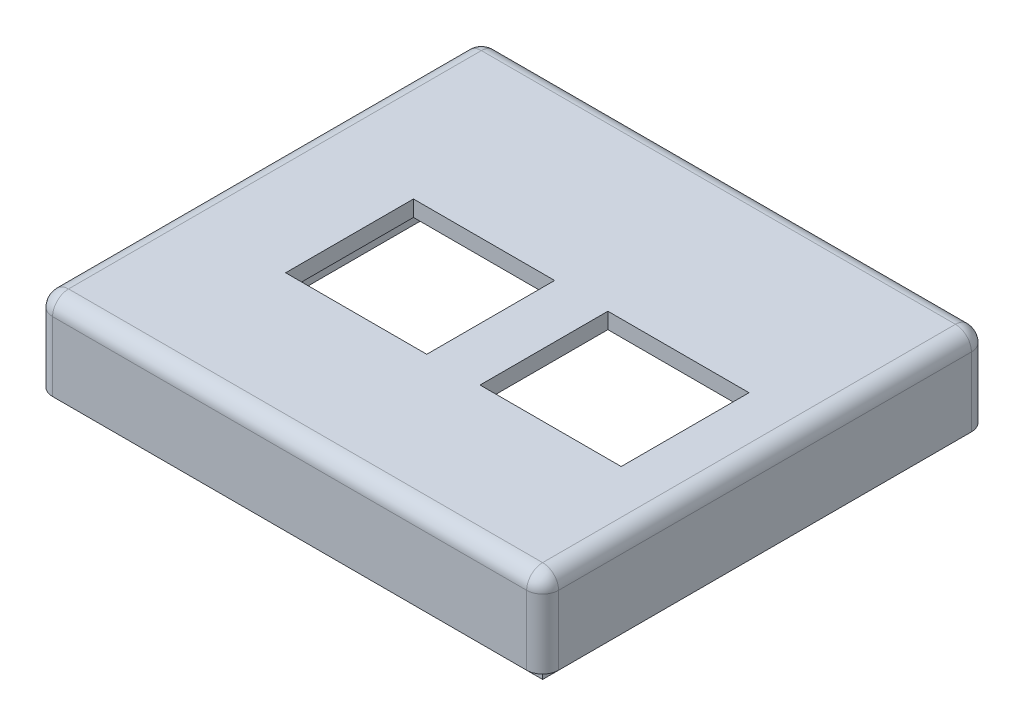
ISO-10303-21;
HEADER;
FILE_DESCRIPTION(('STEP AP214'),'2;1');
FILE_NAME('part.step','',(''),(''),'','','');
FILE_SCHEMA(('AUTOMOTIVE_DESIGN { 1 0 10303 214 1 1 1 1 }'));
ENDSEC;
DATA;
#1=APPLICATION_CONTEXT('core data for automotive mechanical design processes');
#2=APPLICATION_PROTOCOL_DEFINITION('international standard','automotive_design',2000,#1);
#3=PRODUCT_CONTEXT('',#1,'mechanical');
#4=PRODUCT('Part','Part','',(#3));
#5=PRODUCT_RELATED_PRODUCT_CATEGORY('part','',(#4));
#6=PRODUCT_DEFINITION_FORMATION('','',#4);
#7=PRODUCT_DEFINITION_CONTEXT('part definition',#1,'design');
#8=PRODUCT_DEFINITION('design','',#6,#7);
#9=PRODUCT_DEFINITION_SHAPE('','',#8);
#10=(LENGTH_UNIT() NAMED_UNIT(*) SI_UNIT(.MILLI.,.METRE.));
#11=(NAMED_UNIT(*) PLANE_ANGLE_UNIT() SI_UNIT($,.RADIAN.));
#12=(NAMED_UNIT(*) SI_UNIT($,.STERADIAN.) SOLID_ANGLE_UNIT());
#13=UNCERTAINTY_MEASURE_WITH_UNIT(LENGTH_MEASURE(1.E-05),#10,'distance_accuracy_value','');
#14=(GEOMETRIC_REPRESENTATION_CONTEXT(3) GLOBAL_UNCERTAINTY_ASSIGNED_CONTEXT((#13)) GLOBAL_UNIT_ASSIGNED_CONTEXT((#10,
#11,#12)) REPRESENTATION_CONTEXT('',''));
#15=CARTESIAN_POINT('',(0.,0.,0.));
#16=DIRECTION('',(0.,0.,1.));
#17=DIRECTION('',(1.,0.,0.));
#18=AXIS2_PLACEMENT_3D('',#15,#16,#17);
#19=CARTESIAN_POINT('',(44.5,-19.,0.));
#20=DIRECTION('',(1.,0.,0.));
#21=DIRECTION('',(0.,0.,-1.));
#22=AXIS2_PLACEMENT_3D('',#19,#20,#21);
#23=PLANE('',#22);
#24=DIRECTION('',(0.,-1.,0.));
#25=VECTOR('',#24,1.);
#26=CARTESIAN_POINT('',(44.5,-19.,35.75));
#27=LINE('',#26,#25);
#28=CARTESIAN_POINT('',(44.5,-16.,35.75));
#29=VERTEX_POINT('',#28);
#30=CARTESIAN_POINT('',(44.5,-19.,35.75));
#31=VERTEX_POINT('',#30);
#32=EDGE_CURVE('E368',#29,#31,#27,.T.);
#33=ORIENTED_EDGE('',*,*,#32,.F.);
#34=DIRECTION('',(0.,0.,-1.));
#35=VECTOR('',#34,1.);
#36=CARTESIAN_POINT('',(44.5,-16.,0.));
#37=LINE('',#36,#35);
#38=CARTESIAN_POINT('',(44.5,-16.,38.75));
#39=VERTEX_POINT('',#38);
#40=EDGE_CURVE('E468',#39,#29,#37,.T.);
#41=ORIENTED_EDGE('',*,*,#40,.F.);
#42=DIRECTION('',(0.,1.,0.));
#43=VECTOR('',#42,1.);
#44=CARTESIAN_POINT('',(44.5,-19.,38.75));
#45=LINE('',#44,#43);
#46=CARTESIAN_POINT('',(44.5,-19.,38.75));
#47=VERTEX_POINT('',#46);
#48=EDGE_CURVE('E407',#47,#39,#45,.T.);
#49=ORIENTED_EDGE('',*,*,#48,.F.);
#50=DIRECTION('',(0.,0.,-1.));
#51=VECTOR('',#50,1.);
#52=CARTESIAN_POINT('',(44.5,-19.,0.));
#53=LINE('',#52,#51);
#54=EDGE_CURVE('E394',#47,#31,#53,.T.);
#55=ORIENTED_EDGE('',*,*,#54,.T.);
#56=EDGE_LOOP('',(#33,#41,#49,#55));
#57=FACE_BOUND('',#56,.T.);
#58=ADVANCED_FACE('F37',(#57),#23,.T.);
#59=DIRECTION('',(0.,1.,0.));
#60=VECTOR('',#59,1.);
#61=CARTESIAN_POINT('',(44.5,-19.,29.75));
#62=LINE('',#61,#60);
#63=CARTESIAN_POINT('',(44.5,-19.,29.75));
#64=VERTEX_POINT('',#63);
#65=CARTESIAN_POINT('',(44.5,-16.,29.75));
#66=VERTEX_POINT('',#65);
#67=EDGE_CURVE('E365',#64,#66,#62,.T.);
#68=ORIENTED_EDGE('',*,*,#67,.F.);
#69=CARTESIAN_POINT('',(44.5,-19.,1.75));
#70=VERTEX_POINT('',#69);
#71=EDGE_CURVE('E399',#64,#70,#53,.T.);
#72=ORIENTED_EDGE('',*,*,#71,.T.);
#73=DIRECTION('',(0.,-1.,0.));
#74=VECTOR('',#73,1.);
#75=CARTESIAN_POINT('',(44.5,-19.,1.75));
#76=LINE('',#75,#74);
#77=CARTESIAN_POINT('',(44.5,-16.,1.75));
#78=VERTEX_POINT('',#77);
#79=EDGE_CURVE('E358',#78,#70,#76,.T.);
#80=ORIENTED_EDGE('',*,*,#79,.F.);
#81=EDGE_CURVE('E473',#66,#78,#37,.T.);
#82=ORIENTED_EDGE('',*,*,#81,.F.);
#83=EDGE_LOOP('',(#68,#72,#80,#82));
#84=FACE_BOUND('',#83,.T.);
#85=ADVANCED_FACE('F615',(#84),#23,.T.);
#86=CARTESIAN_POINT('',(0.,-19.,0.));
#87=DIRECTION('',(0.,1.,0.));
#88=DIRECTION('',(0.,0.,1.));
#89=AXIS2_PLACEMENT_3D('',#86,#87,#88);
#90=PLANE('',#89);
#91=DIRECTION('',(1.,0.,0.));
#92=VECTOR('',#91,1.);
#93=CARTESIAN_POINT('',(0.,-19.,35.75));
#94=LINE('',#93,#92);
#95=CARTESIAN_POINT('',(-41.5,-19.,35.75));
#96=VERTEX_POINT('',#95);
#97=EDGE_CURVE('E378',#96,#31,#94,.T.);
#98=ORIENTED_EDGE('',*,*,#97,.T.);
#99=ORIENTED_EDGE('',*,*,#54,.F.);
#100=DIRECTION('',(1.,0.,0.));
#101=VECTOR('',#100,1.);
#102=CARTESIAN_POINT('',(0.,-19.,38.75));
#103=LINE('',#102,#101);
#104=CARTESIAN_POINT('',(-44.5,-19.,38.75));
#105=VERTEX_POINT('',#104);
#106=EDGE_CURVE('E389',#105,#47,#103,.T.);
#107=ORIENTED_EDGE('',*,*,#106,.F.);
#108=DIRECTION('',(0.,0.,-1.));
#109=VECTOR('',#108,1.);
#110=CARTESIAN_POINT('',(-44.5,-19.,0.));
#111=LINE('',#110,#109);
#112=CARTESIAN_POINT('',(-44.5,-19.,-38.75));
#113=VERTEX_POINT('',#112);
#114=EDGE_CURVE('E403',#105,#113,#111,.T.);
#115=ORIENTED_EDGE('',*,*,#114,.T.);
#116=DIRECTION('',(1.,0.,0.));
#117=VECTOR('',#116,1.);
#118=CARTESIAN_POINT('',(0.,-19.,-38.75));
#119=LINE('',#118,#117);
#120=CARTESIAN_POINT('',(44.5,-19.,-38.75));
#121=VERTEX_POINT('',#120);
#122=EDGE_CURVE('E398',#113,#121,#119,.T.);
#123=ORIENTED_EDGE('',*,*,#122,.T.);
#124=CARTESIAN_POINT('',(44.5,-19.,-4.25));
#125=VERTEX_POINT('',#124);
#126=EDGE_CURVE('E393',#125,#121,#53,.T.);
#127=ORIENTED_EDGE('',*,*,#126,.F.);
#128=DIRECTION('',(-1.,0.,0.));
#129=VECTOR('',#128,1.);
#130=CARTESIAN_POINT('',(0.,-19.,-4.25));
#131=LINE('',#130,#129);
#132=CARTESIAN_POINT('',(41.5,-19.,-4.25));
#133=VERTEX_POINT('',#132);
#134=EDGE_CURVE('E331',#125,#133,#131,.T.);
#135=ORIENTED_EDGE('',*,*,#134,.T.);
#136=DIRECTION('',(0.,0.,-1.));
#137=VECTOR('',#136,1.);
#138=CARTESIAN_POINT('',(41.5,-19.,0.));
#139=LINE('',#138,#137);
#140=CARTESIAN_POINT('',(41.5,-19.,-35.75));
#141=VERTEX_POINT('',#140);
#142=EDGE_CURVE('E373',#133,#141,#139,.T.);
#143=ORIENTED_EDGE('',*,*,#142,.T.);
#144=DIRECTION('',(1.,0.,0.));
#145=VECTOR('',#144,1.);
#146=CARTESIAN_POINT('',(0.,-19.,-35.75));
#147=LINE('',#146,#145);
#148=CARTESIAN_POINT('',(-41.5,-19.,-35.75));
#149=VERTEX_POINT('',#148);
#150=EDGE_CURVE('E385',#149,#141,#147,.T.);
#151=ORIENTED_EDGE('',*,*,#150,.F.);
#152=DIRECTION('',(0.,0.,-1.));
#153=VECTOR('',#152,1.);
#154=CARTESIAN_POINT('',(-41.5,-19.,0.));
#155=LINE('',#154,#153);
#156=EDGE_CURVE('E381',#96,#149,#155,.T.);
#157=ORIENTED_EDGE('',*,*,#156,.F.);
#158=EDGE_LOOP('',(#98,#99,#107,#115,#123,#127,#135,#143,#151,#157));
#159=FACE_BOUND('',#158,.T.);
#160=ADVANCED_FACE('F604',(#159),#90,.F.);
#161=CARTESIAN_POINT('',(0.,-3.,41.75));
#162=DIRECTION('',(0.,0.,1.));
#163=DIRECTION('',(1.,0.,0.));
#164=AXIS2_PLACEMENT_3D('',#161,#162,#163);
#165=PLANE('',#164);
#166=DIRECTION('',(1.,0.,0.));
#167=VECTOR('',#166,1.);
#168=CARTESIAN_POINT('',(0.,-16.,41.75));
#169=LINE('',#168,#167);
#170=CARTESIAN_POINT('',(-44.5,-16.,41.75));
#171=VERTEX_POINT('',#170);
#172=CARTESIAN_POINT('',(44.5,-16.,41.75));
#173=VERTEX_POINT('',#172);
#174=EDGE_CURVE('E412',#171,#173,#169,.T.);
#175=ORIENTED_EDGE('',*,*,#174,.T.);
#176=DIRECTION('',(0.,1.,0.));
#177=VECTOR('',#176,1.);
#178=CARTESIAN_POINT('',(44.5,-3.,41.75));
#179=LINE('',#178,#177);
#180=CARTESIAN_POINT('',(44.5,-3.,41.75));
#181=VERTEX_POINT('',#180);
#182=EDGE_CURVE('E531',#173,#181,#179,.T.);
#183=ORIENTED_EDGE('',*,*,#182,.T.);
#184=DIRECTION('',(1.,0.,0.));
#185=VECTOR('',#184,1.);
#186=CARTESIAN_POINT('',(0.,-3.,41.75));
#187=LINE('',#186,#185);
#188=CARTESIAN_POINT('',(-44.5,-3.,41.75));
#189=VERTEX_POINT('',#188);
#190=EDGE_CURVE('E525',#181,#189,#187,.F.);
#191=ORIENTED_EDGE('',*,*,#190,.T.);
#192=DIRECTION('',(0.,1.,0.));
#193=VECTOR('',#192,1.);
#194=CARTESIAN_POINT('',(-44.5,-16.,41.75));
#195=LINE('',#194,#193);
#196=EDGE_CURVE('E528',#189,#171,#195,.F.);
#197=ORIENTED_EDGE('',*,*,#196,.T.);
#198=EDGE_LOOP('',(#175,#183,#191,#197));
#199=FACE_BOUND('',#198,.T.);
#200=ADVANCED_FACE('F708',(#199),#165,.T.);
#201=CARTESIAN_POINT('',(-47.5,-3.,0.));
#202=DIRECTION('',(1.,0.,0.));
#203=DIRECTION('',(0.,0.,-1.));
#204=AXIS2_PLACEMENT_3D('',#201,#202,#203);
#205=PLANE('',#204);
#206=DIRECTION('',(0.,0.,-1.));
#207=VECTOR('',#206,1.);
#208=CARTESIAN_POINT('',(-47.5,-3.,-41.75));
#209=LINE('',#208,#207);
#210=CARTESIAN_POINT('',(-47.5,-3.,38.75));
#211=VERTEX_POINT('',#210);
#212=CARTESIAN_POINT('',(-47.5,-3.,-38.75));
#213=VERTEX_POINT('',#212);
#214=EDGE_CURVE('E494',#211,#213,#209,.T.);
#215=ORIENTED_EDGE('',*,*,#214,.T.);
#216=DIRECTION('',(0.,1.,0.));
#217=VECTOR('',#216,1.);
#218=CARTESIAN_POINT('',(-47.5,-3.,-38.75));
#219=LINE('',#218,#217);
#220=CARTESIAN_POINT('',(-47.5,-16.,-38.75));
#221=VERTEX_POINT('',#220);
#222=EDGE_CURVE('E500',#213,#221,#219,.F.);
#223=ORIENTED_EDGE('',*,*,#222,.T.);
#224=DIRECTION('',(0.,0.,-1.));
#225=VECTOR('',#224,1.);
#226=CARTESIAN_POINT('',(-47.5,-16.,0.));
#227=LINE('',#226,#225);
#228=CARTESIAN_POINT('',(-47.5,-16.,38.75));
#229=VERTEX_POINT('',#228);
#230=EDGE_CURVE('E434',#229,#221,#227,.T.);
#231=ORIENTED_EDGE('',*,*,#230,.F.);
#232=DIRECTION('',(0.,1.,0.));
#233=VECTOR('',#232,1.);
#234=CARTESIAN_POINT('',(-47.5,0.,38.75));
#235=LINE('',#234,#233);
#236=EDGE_CURVE('E497',#229,#211,#235,.T.);
#237=ORIENTED_EDGE('',*,*,#236,.T.);
#238=EDGE_LOOP('',(#215,#223,#231,#237));
#239=FACE_BOUND('',#238,.T.);
#240=ADVANCED_FACE('F704',(#239),#205,.F.);
#241=CARTESIAN_POINT('',(0.,-3.,-41.75));
#242=DIRECTION('',(0.,0.,1.));
#243=DIRECTION('',(1.,0.,0.));
#244=AXIS2_PLACEMENT_3D('',#241,#242,#243);
#245=PLANE('',#244);
#246=DIRECTION('',(1.,0.,0.));
#247=VECTOR('',#246,1.);
#248=CARTESIAN_POINT('',(0.,-16.,-41.75));
#249=LINE('',#248,#247);
#250=CARTESIAN_POINT('',(-44.5,-16.,-41.75));
#251=VERTEX_POINT('',#250);
#252=CARTESIAN_POINT('',(44.5,-16.,-41.75));
#253=VERTEX_POINT('',#252);
#254=EDGE_CURVE('E430',#251,#253,#249,.T.);
#255=ORIENTED_EDGE('',*,*,#254,.F.);
#256=DIRECTION('',(0.,1.,0.));
#257=VECTOR('',#256,1.);
#258=CARTESIAN_POINT('',(-44.5,-3.,-41.75));
#259=LINE('',#258,#257);
#260=CARTESIAN_POINT('',(-44.5,-3.,-41.75));
#261=VERTEX_POINT('',#260);
#262=EDGE_CURVE('E490',#251,#261,#259,.T.);
#263=ORIENTED_EDGE('',*,*,#262,.T.);
#264=DIRECTION('',(1.,0.,0.));
#265=VECTOR('',#264,1.);
#266=CARTESIAN_POINT('',(47.5,-3.,-41.75));
#267=LINE('',#266,#265);
#268=CARTESIAN_POINT('',(44.5,-3.,-41.75));
#269=VERTEX_POINT('',#268);
#270=EDGE_CURVE('E484',#261,#269,#267,.T.);
#271=ORIENTED_EDGE('',*,*,#270,.T.);
#272=DIRECTION('',(0.,1.,0.));
#273=VECTOR('',#272,1.);
#274=CARTESIAN_POINT('',(44.5,-16.,-41.75));
#275=LINE('',#274,#273);
#276=EDGE_CURVE('E487',#269,#253,#275,.F.);
#277=ORIENTED_EDGE('',*,*,#276,.T.);
#278=EDGE_LOOP('',(#255,#263,#271,#277));
#279=FACE_BOUND('',#278,.T.);
#280=ADVANCED_FACE('F707',(#279),#245,.F.);
#281=CARTESIAN_POINT('',(47.5,-3.,0.));
#282=DIRECTION('',(1.,0.,0.));
#283=DIRECTION('',(0.,0.,-1.));
#284=AXIS2_PLACEMENT_3D('',#281,#282,#283);
#285=PLANE('',#284);
#286=DIRECTION('',(0.,0.,-1.));
#287=VECTOR('',#286,1.);
#288=CARTESIAN_POINT('',(47.5,-16.,0.));
#289=LINE('',#288,#287);
#290=CARTESIAN_POINT('',(47.5,-16.,38.75));
#291=VERTEX_POINT('',#290);
#292=CARTESIAN_POINT('',(47.5,-16.,-38.75));
#293=VERTEX_POINT('',#292);
#294=EDGE_CURVE('E427',#291,#293,#289,.T.);
#295=ORIENTED_EDGE('',*,*,#294,.T.);
#296=DIRECTION('',(0.,1.,0.));
#297=VECTOR('',#296,1.);
#298=CARTESIAN_POINT('',(47.5,0.,-38.75));
#299=LINE('',#298,#297);
#300=CARTESIAN_POINT('',(47.5,-3.,-38.75));
#301=VERTEX_POINT('',#300);
#302=EDGE_CURVE('E522',#293,#301,#299,.T.);
#303=ORIENTED_EDGE('',*,*,#302,.T.);
#304=DIRECTION('',(0.,0.,-1.));
#305=VECTOR('',#304,1.);
#306=CARTESIAN_POINT('',(47.5,-3.,0.));
#307=LINE('',#306,#305);
#308=CARTESIAN_POINT('',(47.5,-3.,38.75));
#309=VERTEX_POINT('',#308);
#310=EDGE_CURVE('E516',#301,#309,#307,.F.);
#311=ORIENTED_EDGE('',*,*,#310,.T.);
#312=DIRECTION('',(0.,1.,0.));
#313=VECTOR('',#312,1.);
#314=CARTESIAN_POINT('',(47.5,-3.,38.75));
#315=LINE('',#314,#313);
#316=EDGE_CURVE('E519',#309,#291,#315,.F.);
#317=ORIENTED_EDGE('',*,*,#316,.T.);
#318=EDGE_LOOP('',(#295,#303,#311,#317));
#319=FACE_BOUND('',#318,.T.);
#320=ADVANCED_FACE('F703',(#319),#285,.T.);
#321=CARTESIAN_POINT('',(0.,0.,0.));
#322=DIRECTION('',(0.,1.,0.));
#323=DIRECTION('',(0.,0.,1.));
#324=AXIS2_PLACEMENT_3D('',#321,#322,#323);
#325=PLANE('',#324);
#326=DIRECTION('',(0.,0.,1.));
#327=VECTOR('',#326,1.);
#328=CARTESIAN_POINT('',(-0.250000000000004,0.,-8.25));
#329=LINE('',#328,#327);
#330=CARTESIAN_POINT('',(-0.250000000000004,0.,-8.25));
#331=VERTEX_POINT('',#330);
#332=CARTESIAN_POINT('',(-0.250000000000004,0.,15.75));
#333=VERTEX_POINT('',#332);
#334=EDGE_CURVE('E265',#331,#333,#329,.T.);
#335=ORIENTED_EDGE('',*,*,#334,.T.);
#336=DIRECTION('',(-1.,0.,0.));
#337=VECTOR('',#336,1.);
#338=CARTESIAN_POINT('',(-26.75,0.,15.75));
#339=LINE('',#338,#337);
#340=CARTESIAN_POINT('',(-26.75,0.,15.75));
#341=VERTEX_POINT('',#340);
#342=EDGE_CURVE('E252',#333,#341,#339,.T.);
#343=ORIENTED_EDGE('',*,*,#342,.T.);
#344=DIRECTION('',(0.,0.,-1.));
#345=VECTOR('',#344,1.);
#346=CARTESIAN_POINT('',(-26.75,0.,-8.25));
#347=LINE('',#346,#345);
#348=CARTESIAN_POINT('',(-26.75,0.,-8.25));
#349=VERTEX_POINT('',#348);
#350=EDGE_CURVE('E278',#341,#349,#347,.T.);
#351=ORIENTED_EDGE('',*,*,#350,.T.);
#352=DIRECTION('',(1.,0.,0.));
#353=VECTOR('',#352,1.);
#354=CARTESIAN_POINT('',(-26.75,0.,-8.25));
#355=LINE('',#354,#353);
#356=EDGE_CURVE('E274',#349,#331,#355,.T.);
#357=ORIENTED_EDGE('',*,*,#356,.T.);
#358=EDGE_LOOP('',(#335,#343,#351,#357));
#359=FACE_BOUND('',#358,.T.);
#360=DIRECTION('',(0.,0.,1.));
#361=VECTOR('',#360,1.);
#362=CARTESIAN_POINT('',(36.25,0.,-8.25));
#363=LINE('',#362,#361);
#364=CARTESIAN_POINT('',(36.25,0.,-8.25));
#365=VERTEX_POINT('',#364);
#366=CARTESIAN_POINT('',(36.25,0.,15.75));
#367=VERTEX_POINT('',#366);
#368=EDGE_CURVE('E298',#365,#367,#363,.T.);
#369=ORIENTED_EDGE('',*,*,#368,.T.);
#370=DIRECTION('',(-1.,0.,0.));
#371=VECTOR('',#370,1.);
#372=CARTESIAN_POINT('',(9.75,0.,15.75));
#373=LINE('',#372,#371);
#374=CARTESIAN_POINT('',(9.75,0.,15.75));
#375=VERTEX_POINT('',#374);
#376=EDGE_CURVE('E314',#367,#375,#373,.T.);
#377=ORIENTED_EDGE('',*,*,#376,.T.);
#378=DIRECTION('',(0.,0.,-1.));
#379=VECTOR('',#378,1.);
#380=CARTESIAN_POINT('',(9.75,0.,-8.25));
#381=LINE('',#380,#379);
#382=CARTESIAN_POINT('',(9.75,0.,-8.25));
#383=VERTEX_POINT('',#382);
#384=EDGE_CURVE('E292',#375,#383,#381,.T.);
#385=ORIENTED_EDGE('',*,*,#384,.T.);
#386=DIRECTION('',(1.,0.,0.));
#387=VECTOR('',#386,1.);
#388=CARTESIAN_POINT('',(9.75,0.,-8.25));
#389=LINE('',#388,#387);
#390=EDGE_CURVE('E295',#383,#365,#389,.T.);
#391=ORIENTED_EDGE('',*,*,#390,.T.);
#392=EDGE_LOOP('',(#369,#377,#385,#391));
#393=FACE_BOUND('',#392,.T.);
#394=DIRECTION('',(0.,0.,-1.));
#395=VECTOR('',#394,1.);
#396=CARTESIAN_POINT('',(-44.5,0.,41.75));
#397=LINE('',#396,#395);
#398=CARTESIAN_POINT('',(-44.5,0.,-38.75));
#399=VERTEX_POINT('',#398);
#400=CARTESIAN_POINT('',(-44.5,0.,38.75));
#401=VERTEX_POINT('',#400);
#402=EDGE_CURVE('E534',#399,#401,#397,.F.);
#403=ORIENTED_EDGE('',*,*,#402,.T.);
#404=DIRECTION('',(1.,0.,0.));
#405=VECTOR('',#404,1.);
#406=CARTESIAN_POINT('',(0.,0.,38.75));
#407=LINE('',#406,#405);
#408=CARTESIAN_POINT('',(44.5,0.,38.75));
#409=VERTEX_POINT('',#408);
#410=EDGE_CURVE('E543',#401,#409,#407,.T.);
#411=ORIENTED_EDGE('',*,*,#410,.T.);
#412=DIRECTION('',(0.,0.,-1.));
#413=VECTOR('',#412,1.);
#414=CARTESIAN_POINT('',(44.5,0.,0.));
#415=LINE('',#414,#413);
#416=CARTESIAN_POINT('',(44.5,0.,-38.75));
#417=VERTEX_POINT('',#416);
#418=EDGE_CURVE('E540',#409,#417,#415,.T.);
#419=ORIENTED_EDGE('',*,*,#418,.T.);
#420=DIRECTION('',(1.,0.,0.));
#421=VECTOR('',#420,1.);
#422=CARTESIAN_POINT('',(-47.5,0.,-38.75));
#423=LINE('',#422,#421);
#424=EDGE_CURVE('E537',#417,#399,#423,.F.);
#425=ORIENTED_EDGE('',*,*,#424,.T.);
#426=EDGE_LOOP('',(#403,#411,#419,#425));
#427=FACE_BOUND('',#426,.T.);
#428=ADVANCED_FACE('F272',(#359,#393,#427),#325,.T.);
#429=CARTESIAN_POINT('',(0.,-16.,0.));
#430=DIRECTION('',(0.,1.,0.));
#431=DIRECTION('',(0.,0.,1.));
#432=AXIS2_PLACEMENT_3D('',#429,#430,#431);
#433=PLANE('',#432);
#434=CARTESIAN_POINT('',(44.5,-16.,-38.75));
#435=DIRECTION('',(0.,1.,0.));
#436=DIRECTION('',(0.,0.,1.));
#437=AXIS2_PLACEMENT_3D('',#434,#435,#436);
#438=CIRCLE('',#437,3.);
#439=EDGE_CURVE('E509',#253,#293,#438,.F.);
#440=ORIENTED_EDGE('',*,*,#439,.T.);
#441=ORIENTED_EDGE('',*,*,#294,.F.);
#442=CARTESIAN_POINT('',(44.5,-16.,38.75));
#443=DIRECTION('',(0.,1.,0.));
#444=DIRECTION('',(0.,0.,1.));
#445=AXIS2_PLACEMENT_3D('',#442,#443,#444);
#446=CIRCLE('',#445,3.);
#447=EDGE_CURVE('E506',#291,#173,#446,.F.);
#448=ORIENTED_EDGE('',*,*,#447,.T.);
#449=ORIENTED_EDGE('',*,*,#174,.F.);
#450=CARTESIAN_POINT('',(-44.5,-16.,38.75));
#451=DIRECTION('',(0.,1.,0.));
#452=DIRECTION('',(0.,0.,1.));
#453=AXIS2_PLACEMENT_3D('',#450,#451,#452);
#454=CIRCLE('',#453,3.);
#455=EDGE_CURVE('E503',#171,#229,#454,.F.);
#456=ORIENTED_EDGE('',*,*,#455,.T.);
#457=ORIENTED_EDGE('',*,*,#230,.T.);
#458=CARTESIAN_POINT('',(-44.5,-16.,-38.75));
#459=DIRECTION('',(0.,1.,0.));
#460=DIRECTION('',(0.,0.,1.));
#461=AXIS2_PLACEMENT_3D('',#458,#459,#460);
#462=CIRCLE('',#461,3.);
#463=EDGE_CURVE('E513',#221,#251,#462,.F.);
#464=ORIENTED_EDGE('',*,*,#463,.T.);
#465=ORIENTED_EDGE('',*,*,#254,.T.);
#466=EDGE_LOOP('',(#440,#441,#448,#449,#456,#457,#464,#465));
#467=FACE_BOUND('',#466,.T.);
#468=ORIENTED_EDGE('',*,*,#40,.T.);
#469=DIRECTION('',(1.,0.,0.));
#470=VECTOR('',#469,1.);
#471=CARTESIAN_POINT('',(41.5,-16.,35.75));
#472=LINE('',#471,#470);
#473=CARTESIAN_POINT('',(41.5,-16.,35.75));
#474=VERTEX_POINT('',#473);
#475=EDGE_CURVE('E328',#474,#29,#472,.T.);
#476=ORIENTED_EDGE('',*,*,#475,.F.);
#477=DIRECTION('',(0.,0.,1.));
#478=VECTOR('',#477,1.);
#479=CARTESIAN_POINT('',(41.5,-16.,35.75));
#480=LINE('',#479,#478);
#481=CARTESIAN_POINT('',(41.5,-16.,29.75));
#482=VERTEX_POINT('',#481);
#483=EDGE_CURVE('E322',#482,#474,#480,.T.);
#484=ORIENTED_EDGE('',*,*,#483,.F.);
#485=DIRECTION('',(1.,0.,0.));
#486=VECTOR('',#485,1.);
#487=CARTESIAN_POINT('',(41.5,-16.,29.75));
#488=LINE('',#487,#486);
#489=EDGE_CURVE('E326',#482,#66,#488,.T.);
#490=ORIENTED_EDGE('',*,*,#489,.T.);
#491=ORIENTED_EDGE('',*,*,#81,.T.);
#492=DIRECTION('',(1.,0.,0.));
#493=VECTOR('',#492,1.);
#494=CARTESIAN_POINT('',(41.5,-16.,1.75));
#495=LINE('',#494,#493);
#496=CARTESIAN_POINT('',(41.5,-16.,1.75));
#497=VERTEX_POINT('',#496);
#498=EDGE_CURVE('E327',#497,#78,#495,.T.);
#499=ORIENTED_EDGE('',*,*,#498,.F.);
#500=DIRECTION('',(0.,0.,1.));
#501=VECTOR('',#500,1.);
#502=CARTESIAN_POINT('',(41.5,-16.,1.75));
#503=LINE('',#502,#501);
#504=CARTESIAN_POINT('',(41.5,-16.,-4.25));
#505=VERTEX_POINT('',#504);
#506=EDGE_CURVE('E338',#505,#497,#503,.T.);
#507=ORIENTED_EDGE('',*,*,#506,.F.);
#508=DIRECTION('',(1.,0.,0.));
#509=VECTOR('',#508,1.);
#510=CARTESIAN_POINT('',(41.5,-16.,-4.25));
#511=LINE('',#510,#509);
#512=CARTESIAN_POINT('',(44.5,-16.,-4.25));
#513=VERTEX_POINT('',#512);
#514=EDGE_CURVE('E342',#505,#513,#511,.T.);
#515=ORIENTED_EDGE('',*,*,#514,.T.);
#516=CARTESIAN_POINT('',(44.5,-16.,-38.75));
#517=VERTEX_POINT('',#516);
#518=EDGE_CURVE('E467',#513,#517,#37,.T.);
#519=ORIENTED_EDGE('',*,*,#518,.T.);
#520=DIRECTION('',(1.,0.,0.));
#521=VECTOR('',#520,1.);
#522=CARTESIAN_POINT('',(0.,-16.,-38.75));
#523=LINE('',#522,#521);
#524=CARTESIAN_POINT('',(-44.5,-16.,-38.75));
#525=VERTEX_POINT('',#524);
#526=EDGE_CURVE('E472',#525,#517,#523,.T.);
#527=ORIENTED_EDGE('',*,*,#526,.F.);
#528=DIRECTION('',(0.,0.,-1.));
#529=VECTOR('',#528,1.);
#530=CARTESIAN_POINT('',(-44.5,-16.,0.));
#531=LINE('',#530,#529);
#532=CARTESIAN_POINT('',(-44.5,-16.,38.75));
#533=VERTEX_POINT('',#532);
#534=EDGE_CURVE('E477',#533,#525,#531,.T.);
#535=ORIENTED_EDGE('',*,*,#534,.F.);
#536=DIRECTION('',(1.,0.,0.));
#537=VECTOR('',#536,1.);
#538=CARTESIAN_POINT('',(0.,-16.,38.75));
#539=LINE('',#538,#537);
#540=EDGE_CURVE('E480',#533,#39,#539,.T.);
#541=ORIENTED_EDGE('',*,*,#540,.T.);
#542=EDGE_LOOP('',(#468,#476,#484,#490,#491,#499,#507,#515,#519,#527,#535,#541));
#543=FACE_BOUND('',#542,.T.);
#544=ADVANCED_FACE('F630',(#467,#543),#433,.F.);
#545=CARTESIAN_POINT('',(0.,-19.,38.75));
#546=DIRECTION('',(0.,0.,1.));
#547=DIRECTION('',(1.,0.,0.));
#548=AXIS2_PLACEMENT_3D('',#545,#546,#547);
#549=PLANE('',#548);
#550=ORIENTED_EDGE('',*,*,#540,.F.);
#551=DIRECTION('',(0.,1.,0.));
#552=VECTOR('',#551,1.);
#553=CARTESIAN_POINT('',(-44.5,-19.,38.75));
#554=LINE('',#553,#552);
#555=EDGE_CURVE('E408',#105,#533,#554,.T.);
#556=ORIENTED_EDGE('',*,*,#555,.F.);
#557=ORIENTED_EDGE('',*,*,#106,.T.);
#558=ORIENTED_EDGE('',*,*,#48,.T.);
#559=EDGE_LOOP('',(#550,#556,#557,#558));
#560=FACE_BOUND('',#559,.T.);
#561=ADVANCED_FACE('F671',(#560),#549,.T.);
#562=CARTESIAN_POINT('',(-44.5,-19.,0.));
#563=DIRECTION('',(1.,0.,0.));
#564=DIRECTION('',(0.,0.,-1.));
#565=AXIS2_PLACEMENT_3D('',#562,#563,#564);
#566=PLANE('',#565);
#567=ORIENTED_EDGE('',*,*,#555,.T.);
#568=ORIENTED_EDGE('',*,*,#534,.T.);
#569=DIRECTION('',(0.,1.,0.));
#570=VECTOR('',#569,1.);
#571=CARTESIAN_POINT('',(-44.5,-19.,-38.75));
#572=LINE('',#571,#570);
#573=EDGE_CURVE('E413',#113,#525,#572,.T.);
#574=ORIENTED_EDGE('',*,*,#573,.F.);
#575=ORIENTED_EDGE('',*,*,#114,.F.);
#576=EDGE_LOOP('',(#567,#568,#574,#575));
#577=FACE_BOUND('',#576,.T.);
#578=ADVANCED_FACE('F663',(#577),#566,.F.);
#579=CARTESIAN_POINT('',(0.,-19.,-38.75));
#580=DIRECTION('',(0.,0.,1.));
#581=DIRECTION('',(1.,0.,0.));
#582=AXIS2_PLACEMENT_3D('',#579,#580,#581);
#583=PLANE('',#582);
#584=ORIENTED_EDGE('',*,*,#573,.T.);
#585=ORIENTED_EDGE('',*,*,#526,.T.);
#586=DIRECTION('',(0.,1.,0.));
#587=VECTOR('',#586,1.);
#588=CARTESIAN_POINT('',(44.5,-19.,-38.75));
#589=LINE('',#588,#587);
#590=EDGE_CURVE('E417',#121,#517,#589,.T.);
#591=ORIENTED_EDGE('',*,*,#590,.F.);
#592=ORIENTED_EDGE('',*,*,#122,.F.);
#593=EDGE_LOOP('',(#584,#585,#591,#592));
#594=FACE_BOUND('',#593,.T.);
#595=ADVANCED_FACE('F656',(#594),#583,.F.);
#596=DIRECTION('',(0.,1.,0.));
#597=VECTOR('',#596,1.);
#598=CARTESIAN_POINT('',(44.5,-19.,-4.25));
#599=LINE('',#598,#597);
#600=EDGE_CURVE('E351',#125,#513,#599,.T.);
#601=ORIENTED_EDGE('',*,*,#600,.F.);
#602=ORIENTED_EDGE('',*,*,#126,.T.);
#603=ORIENTED_EDGE('',*,*,#590,.T.);
#604=ORIENTED_EDGE('',*,*,#518,.F.);
#605=EDGE_LOOP('',(#601,#602,#603,#604));
#606=FACE_BOUND('',#605,.T.);
#607=ADVANCED_FACE('F648',(#606),#23,.T.);
#608=ORIENTED_EDGE('',*,*,#71,.F.);
#609=DIRECTION('',(-1.,0.,0.));
#610=VECTOR('',#609,1.);
#611=CARTESIAN_POINT('',(0.,-19.,29.75));
#612=LINE('',#611,#610);
#613=CARTESIAN_POINT('',(41.5,-19.,29.75));
#614=VERTEX_POINT('',#613);
#615=EDGE_CURVE('E361',#64,#614,#612,.T.);
#616=ORIENTED_EDGE('',*,*,#615,.T.);
#617=CARTESIAN_POINT('',(41.5,-19.,1.75));
#618=VERTEX_POINT('',#617);
#619=EDGE_CURVE('E376',#614,#618,#139,.T.);
#620=ORIENTED_EDGE('',*,*,#619,.T.);
#621=DIRECTION('',(1.,0.,0.));
#622=VECTOR('',#621,1.);
#623=CARTESIAN_POINT('',(0.,-19.,1.75));
#624=LINE('',#623,#622);
#625=EDGE_CURVE('E354',#618,#70,#624,.T.);
#626=ORIENTED_EDGE('',*,*,#625,.T.);
#627=EDGE_LOOP('',(#608,#616,#620,#626));
#628=FACE_BOUND('',#627,.T.);
#629=ADVANCED_FACE('F619',(#628),#90,.F.);
#630=CARTESIAN_POINT('',(0.,-3.,0.));
#631=DIRECTION('',(0.,1.,0.));
#632=DIRECTION('',(0.,0.,1.));
#633=AXIS2_PLACEMENT_3D('',#630,#631,#632);
#634=PLANE('',#633);
#635=DIRECTION('',(-1.,0.,0.));
#636=VECTOR('',#635,1.);
#637=CARTESIAN_POINT('',(-26.75,-3.,15.75));
#638=LINE('',#637,#636);
#639=CARTESIAN_POINT('',(-0.250000000000004,-3.,15.75));
#640=VERTEX_POINT('',#639);
#641=CARTESIAN_POINT('',(-26.75,-3.,15.75));
#642=VERTEX_POINT('',#641);
#643=EDGE_CURVE('E276',#640,#642,#638,.T.);
#644=ORIENTED_EDGE('',*,*,#643,.F.);
#645=DIRECTION('',(0.,0.,1.));
#646=VECTOR('',#645,1.);
#647=CARTESIAN_POINT('',(-0.250000000000004,-3.,-8.25));
#648=LINE('',#647,#646);
#649=CARTESIAN_POINT('',(-0.250000000000004,-3.,-8.25));
#650=VERTEX_POINT('',#649);
#651=EDGE_CURVE('E268',#650,#640,#648,.T.);
#652=ORIENTED_EDGE('',*,*,#651,.F.);
#653=DIRECTION('',(1.,0.,0.));
#654=VECTOR('',#653,1.);
#655=CARTESIAN_POINT('',(-26.75,-3.,-8.25));
#656=LINE('',#655,#654);
#657=CARTESIAN_POINT('',(-26.75,-3.,-8.25));
#658=VERTEX_POINT('',#657);
#659=EDGE_CURVE('E269',#658,#650,#656,.T.);
#660=ORIENTED_EDGE('',*,*,#659,.F.);
#661=DIRECTION('',(0.,0.,-1.));
#662=VECTOR('',#661,1.);
#663=CARTESIAN_POINT('',(-26.75,-3.,-8.25));
#664=LINE('',#663,#662);
#665=EDGE_CURVE('E283',#642,#658,#664,.T.);
#666=ORIENTED_EDGE('',*,*,#665,.F.);
#667=EDGE_LOOP('',(#644,#652,#660,#666));
#668=FACE_BOUND('',#667,.T.);
#669=DIRECTION('',(-1.,0.,0.));
#670=VECTOR('',#669,1.);
#671=CARTESIAN_POINT('',(9.75,-3.,15.75));
#672=LINE('',#671,#670);
#673=CARTESIAN_POINT('',(36.25,-3.,15.75));
#674=VERTEX_POINT('',#673);
#675=CARTESIAN_POINT('',(9.75,-3.,15.75));
#676=VERTEX_POINT('',#675);
#677=EDGE_CURVE('E303',#674,#676,#672,.T.);
#678=ORIENTED_EDGE('',*,*,#677,.F.);
#679=DIRECTION('',(0.,0.,1.));
#680=VECTOR('',#679,1.);
#681=CARTESIAN_POINT('',(36.25,-3.,-8.25));
#682=LINE('',#681,#680);
#683=CARTESIAN_POINT('',(36.25,-3.,-8.25));
#684=VERTEX_POINT('',#683);
#685=EDGE_CURVE('E301',#684,#674,#682,.T.);
#686=ORIENTED_EDGE('',*,*,#685,.F.);
#687=DIRECTION('',(1.,0.,0.));
#688=VECTOR('',#687,1.);
#689=CARTESIAN_POINT('',(9.75,-3.,-8.25));
#690=LINE('',#689,#688);
#691=CARTESIAN_POINT('',(9.75,-3.,-8.25));
#692=VERTEX_POINT('',#691);
#693=EDGE_CURVE('E308',#692,#684,#690,.T.);
#694=ORIENTED_EDGE('',*,*,#693,.F.);
#695=DIRECTION('',(0.,0.,-1.));
#696=VECTOR('',#695,1.);
#697=CARTESIAN_POINT('',(9.75,-3.,-8.25));
#698=LINE('',#697,#696);
#699=EDGE_CURVE('E305',#676,#692,#698,.T.);
#700=ORIENTED_EDGE('',*,*,#699,.F.);
#701=EDGE_LOOP('',(#678,#686,#694,#700));
#702=FACE_BOUND('',#701,.T.);
#703=DIRECTION('',(0.,0.,-1.));
#704=VECTOR('',#703,1.);
#705=CARTESIAN_POINT('',(41.5,-3.,0.));
#706=LINE('',#705,#704);
#707=CARTESIAN_POINT('',(41.5,-3.,35.75));
#708=VERTEX_POINT('',#707);
#709=CARTESIAN_POINT('',(41.5,-3.,-35.75));
#710=VERTEX_POINT('',#709);
#711=EDGE_CURVE('E463',#708,#710,#706,.T.);
#712=ORIENTED_EDGE('',*,*,#711,.F.);
#713=DIRECTION('',(1.,0.,0.));
#714=VECTOR('',#713,1.);
#715=CARTESIAN_POINT('',(0.,-3.,35.75));
#716=LINE('',#715,#714);
#717=CARTESIAN_POINT('',(-41.5,-3.,35.75));
#718=VERTEX_POINT('',#717);
#719=EDGE_CURVE('E443',#718,#708,#716,.T.);
#720=ORIENTED_EDGE('',*,*,#719,.F.);
#721=DIRECTION('',(0.,0.,-1.));
#722=VECTOR('',#721,1.);
#723=CARTESIAN_POINT('',(-41.5,-3.,0.));
#724=LINE('',#723,#722);
#725=CARTESIAN_POINT('',(-41.5,-3.,-35.75));
#726=VERTEX_POINT('',#725);
#727=EDGE_CURVE('E457',#718,#726,#724,.T.);
#728=ORIENTED_EDGE('',*,*,#727,.T.);
#729=DIRECTION('',(1.,0.,0.));
#730=VECTOR('',#729,1.);
#731=CARTESIAN_POINT('',(0.,-3.,-35.75));
#732=LINE('',#731,#730);
#733=EDGE_CURVE('E460',#726,#710,#732,.T.);
#734=ORIENTED_EDGE('',*,*,#733,.T.);
#735=EDGE_LOOP('',(#712,#720,#728,#734));
#736=FACE_BOUND('',#735,.T.);
#737=ADVANCED_FACE('F661',(#668,#702,#736),#634,.F.);
#738=CARTESIAN_POINT('',(0.,-16.,35.75));
#739=DIRECTION('',(0.,0.,1.));
#740=DIRECTION('',(1.,0.,0.));
#741=AXIS2_PLACEMENT_3D('',#738,#739,#740);
#742=PLANE('',#741);
#743=DIRECTION('',(0.,1.,0.));
#744=VECTOR('',#743,1.);
#745=CARTESIAN_POINT('',(-41.5,-16.,35.75));
#746=LINE('',#745,#744);
#747=EDGE_CURVE('E448',#96,#718,#746,.T.);
#748=ORIENTED_EDGE('',*,*,#747,.T.);
#749=ORIENTED_EDGE('',*,*,#719,.T.);
#750=DIRECTION('',(0.,1.,0.));
#751=VECTOR('',#750,1.);
#752=CARTESIAN_POINT('',(41.5,-16.,35.75));
#753=LINE('',#752,#751);
#754=EDGE_CURVE('E438',#474,#708,#753,.T.);
#755=ORIENTED_EDGE('',*,*,#754,.F.);
#756=ORIENTED_EDGE('',*,*,#475,.T.);
#757=ORIENTED_EDGE('',*,*,#32,.T.);
#758=ORIENTED_EDGE('',*,*,#97,.F.);
#759=EDGE_LOOP('',(#748,#749,#755,#756,#757,#758));
#760=FACE_BOUND('',#759,.T.);
#761=ADVANCED_FACE('F676',(#760),#742,.F.);
#762=CARTESIAN_POINT('',(-41.5,-16.,0.));
#763=DIRECTION('',(1.,0.,0.));
#764=DIRECTION('',(0.,0.,-1.));
#765=AXIS2_PLACEMENT_3D('',#762,#763,#764);
#766=PLANE('',#765);
#767=ORIENTED_EDGE('',*,*,#727,.F.);
#768=ORIENTED_EDGE('',*,*,#747,.F.);
#769=ORIENTED_EDGE('',*,*,#156,.T.);
#770=DIRECTION('',(0.,1.,0.));
#771=VECTOR('',#770,1.);
#772=CARTESIAN_POINT('',(-41.5,-16.,-35.75));
#773=LINE('',#772,#771);
#774=EDGE_CURVE('E444',#149,#726,#773,.T.);
#775=ORIENTED_EDGE('',*,*,#774,.T.);
#776=EDGE_LOOP('',(#767,#768,#769,#775));
#777=FACE_BOUND('',#776,.T.);
#778=ADVANCED_FACE('F683',(#777),#766,.T.);
#779=CARTESIAN_POINT('',(0.,-16.,-35.75));
#780=DIRECTION('',(0.,0.,1.));
#781=DIRECTION('',(1.,0.,0.));
#782=AXIS2_PLACEMENT_3D('',#779,#780,#781);
#783=PLANE('',#782);
#784=ORIENTED_EDGE('',*,*,#733,.F.);
#785=ORIENTED_EDGE('',*,*,#774,.F.);
#786=ORIENTED_EDGE('',*,*,#150,.T.);
#787=DIRECTION('',(0.,1.,0.));
#788=VECTOR('',#787,1.);
#789=CARTESIAN_POINT('',(41.5,-16.,-35.75));
#790=LINE('',#789,#788);
#791=EDGE_CURVE('E439',#141,#710,#790,.T.);
#792=ORIENTED_EDGE('',*,*,#791,.T.);
#793=EDGE_LOOP('',(#784,#785,#786,#792));
#794=FACE_BOUND('',#793,.T.);
#795=ADVANCED_FACE('F685',(#794),#783,.T.);
#796=CARTESIAN_POINT('',(41.5,-16.,0.));
#797=DIRECTION('',(1.,0.,0.));
#798=DIRECTION('',(0.,0.,-1.));
#799=AXIS2_PLACEMENT_3D('',#796,#797,#798);
#800=PLANE('',#799);
#801=DIRECTION('',(0.,1.,0.));
#802=VECTOR('',#801,1.);
#803=CARTESIAN_POINT('',(41.5,-16.,29.75));
#804=LINE('',#803,#802);
#805=EDGE_CURVE('E11',#614,#482,#804,.T.);
#806=ORIENTED_EDGE('',*,*,#805,.T.);
#807=ORIENTED_EDGE('',*,*,#483,.T.);
#808=ORIENTED_EDGE('',*,*,#754,.T.);
#809=ORIENTED_EDGE('',*,*,#711,.T.);
#810=ORIENTED_EDGE('',*,*,#791,.F.);
#811=ORIENTED_EDGE('',*,*,#142,.F.);
#812=DIRECTION('',(0.,1.,0.));
#813=VECTOR('',#812,1.);
#814=CARTESIAN_POINT('',(41.5,-16.,-4.25));
#815=LINE('',#814,#813);
#816=EDGE_CURVE('E46',#133,#505,#815,.T.);
#817=ORIENTED_EDGE('',*,*,#816,.T.);
#818=ORIENTED_EDGE('',*,*,#506,.T.);
#819=DIRECTION('',(0.,-1.,0.));
#820=VECTOR('',#819,1.);
#821=CARTESIAN_POINT('',(41.5,-16.,1.75));
#822=LINE('',#821,#820);
#823=EDGE_CURVE('E260',#497,#618,#822,.T.);
#824=ORIENTED_EDGE('',*,*,#823,.T.);
#825=ORIENTED_EDGE('',*,*,#619,.F.);
#826=EDGE_LOOP('',(#806,#807,#808,#809,#810,#811,#817,#818,#824,#825));
#827=FACE_BOUND('',#826,.T.);
#828=ADVANCED_FACE('F596',(#827),#800,.F.);
#829=CARTESIAN_POINT('',(44.5,-3.,38.75));
#830=DIRECTION('',(0.,1.,0.));
#831=DIRECTION('',(0.,0.,1.));
#832=AXIS2_PLACEMENT_3D('',#829,#830,#831);
#833=CYLINDRICAL_SURFACE('',#832,3.);
#834=CARTESIAN_POINT('',(44.5,-3.,38.75));
#835=DIRECTION('',(0.,1.,0.));
#836=DIRECTION('',(0.,0.,1.));
#837=AXIS2_PLACEMENT_3D('',#834,#835,#836);
#838=CIRCLE('',#837,3.);
#839=EDGE_CURVE('E377',#181,#309,#838,.T.);
#840=ORIENTED_EDGE('',*,*,#839,.F.);
#841=ORIENTED_EDGE('',*,*,#182,.F.);
#842=ORIENTED_EDGE('',*,*,#447,.F.);
#843=ORIENTED_EDGE('',*,*,#316,.F.);
#844=EDGE_LOOP('',(#840,#841,#842,#843));
#845=FACE_BOUND('',#844,.T.);
#846=ADVANCED_FACE('F39',(#845),#833,.T.);
#847=CARTESIAN_POINT('',(44.5,-3.,38.75));
#848=DIRECTION('',(1.,0.,0.));
#849=DIRECTION('',(0.,0.,-1.));
#850=AXIS2_PLACEMENT_3D('',#847,#848,#849);
#851=SPHERICAL_SURFACE('',#850,3.);
#852=CARTESIAN_POINT('',(44.5,-3.,38.75));
#853=DIRECTION('',(1.,0.,0.));
#854=DIRECTION('',(0.,0.,-1.));
#855=AXIS2_PLACEMENT_3D('',#852,#853,#854);
#856=CIRCLE('',#855,3.);
#857=EDGE_CURVE('E581',#181,#409,#856,.F.);
#858=ORIENTED_EDGE('',*,*,#857,.F.);
#859=ORIENTED_EDGE('',*,*,#839,.T.);
#860=CARTESIAN_POINT('',(44.5,-3.,38.75));
#861=DIRECTION('',(0.,0.,1.));
#862=DIRECTION('',(1.,0.,0.));
#863=AXIS2_PLACEMENT_3D('',#860,#861,#862);
#864=CIRCLE('',#863,3.);
#865=EDGE_CURVE('E585',#409,#309,#864,.F.);
#866=ORIENTED_EDGE('',*,*,#865,.F.);
#867=EDGE_LOOP('',(#858,#859,#866));
#868=FACE_BOUND('',#867,.T.);
#869=ADVANCED_FACE('F757',(#868),#851,.T.);
#870=CARTESIAN_POINT('',(44.5,-3.,-38.75));
#871=DIRECTION('',(0.,-1.,0.));
#872=DIRECTION('',(0.,0.,-1.));
#873=AXIS2_PLACEMENT_3D('',#870,#871,#872);
#874=CYLINDRICAL_SURFACE('',#873,3.);
#875=ORIENTED_EDGE('',*,*,#439,.F.);
#876=ORIENTED_EDGE('',*,*,#276,.F.);
#877=CARTESIAN_POINT('',(44.5,-3.,-38.75));
#878=DIRECTION('',(0.,1.,0.));
#879=DIRECTION('',(0.,0.,1.));
#880=AXIS2_PLACEMENT_3D('',#877,#878,#879);
#881=CIRCLE('',#880,3.);
#882=EDGE_CURVE('E577',#301,#269,#881,.T.);
#883=ORIENTED_EDGE('',*,*,#882,.F.);
#884=ORIENTED_EDGE('',*,*,#302,.F.);
#885=EDGE_LOOP('',(#875,#876,#883,#884));
#886=FACE_BOUND('',#885,.T.);
#887=ADVANCED_FACE('F754',(#886),#874,.T.);
#888=CARTESIAN_POINT('',(44.5,-3.,0.));
#889=DIRECTION('',(0.,0.,-1.));
#890=DIRECTION('',(-1.,0.,0.));
#891=AXIS2_PLACEMENT_3D('',#888,#889,#890);
#892=CYLINDRICAL_SURFACE('',#891,3.);
#893=ORIENTED_EDGE('',*,*,#865,.T.);
#894=ORIENTED_EDGE('',*,*,#310,.F.);
#895=CARTESIAN_POINT('',(44.5,-3.,-38.75));
#896=DIRECTION('',(0.,0.,-1.));
#897=DIRECTION('',(-1.,0.,0.));
#898=AXIS2_PLACEMENT_3D('',#895,#896,#897);
#899=CIRCLE('',#898,3.);
#900=EDGE_CURVE('E573',#417,#301,#899,.T.);
#901=ORIENTED_EDGE('',*,*,#900,.F.);
#902=ORIENTED_EDGE('',*,*,#418,.F.);
#903=EDGE_LOOP('',(#893,#894,#901,#902));
#904=FACE_BOUND('',#903,.T.);
#905=ADVANCED_FACE('F750',(#904),#892,.T.);
#906=CARTESIAN_POINT('',(0.,-3.,38.75));
#907=DIRECTION('',(1.,0.,0.));
#908=DIRECTION('',(0.,0.,-1.));
#909=AXIS2_PLACEMENT_3D('',#906,#907,#908);
#910=CYLINDRICAL_SURFACE('',#909,3.);
#911=ORIENTED_EDGE('',*,*,#857,.T.);
#912=ORIENTED_EDGE('',*,*,#410,.F.);
#913=CARTESIAN_POINT('',(-44.5,-3.,38.75));
#914=DIRECTION('',(-1.,0.,0.));
#915=DIRECTION('',(0.,0.,1.));
#916=AXIS2_PLACEMENT_3D('',#913,#914,#915);
#917=CIRCLE('',#916,3.);
#918=EDGE_CURVE('E569',#189,#401,#917,.T.);
#919=ORIENTED_EDGE('',*,*,#918,.F.);
#920=ORIENTED_EDGE('',*,*,#190,.F.);
#921=EDGE_LOOP('',(#911,#912,#919,#920));
#922=FACE_BOUND('',#921,.T.);
#923=ADVANCED_FACE('F746',(#922),#910,.T.);
#924=CARTESIAN_POINT('',(-44.5,-3.,38.75));
#925=DIRECTION('',(0.,-1.,0.));
#926=DIRECTION('',(0.,0.,-1.));
#927=AXIS2_PLACEMENT_3D('',#924,#925,#926);
#928=CYLINDRICAL_SURFACE('',#927,3.);
#929=ORIENTED_EDGE('',*,*,#455,.F.);
#930=ORIENTED_EDGE('',*,*,#196,.F.);
#931=CARTESIAN_POINT('',(-44.5,-3.,38.75));
#932=DIRECTION('',(0.,1.,0.));
#933=DIRECTION('',(0.,0.,1.));
#934=AXIS2_PLACEMENT_3D('',#931,#932,#933);
#935=CIRCLE('',#934,3.);
#936=EDGE_CURVE('E565',#211,#189,#935,.T.);
#937=ORIENTED_EDGE('',*,*,#936,.F.);
#938=ORIENTED_EDGE('',*,*,#236,.F.);
#939=EDGE_LOOP('',(#929,#930,#937,#938));
#940=FACE_BOUND('',#939,.T.);
#941=ADVANCED_FACE('F742',(#940),#928,.T.);
#942=CARTESIAN_POINT('',(44.5,-3.,-38.75));
#943=DIRECTION('',(1.,0.,0.));
#944=DIRECTION('',(0.,0.,-1.));
#945=AXIS2_PLACEMENT_3D('',#942,#943,#944);
#946=SPHERICAL_SURFACE('',#945,3.);
#947=ORIENTED_EDGE('',*,*,#900,.T.);
#948=ORIENTED_EDGE('',*,*,#882,.T.);
#949=CARTESIAN_POINT('',(44.5,-3.,-38.75));
#950=DIRECTION('',(1.,0.,0.));
#951=DIRECTION('',(0.,0.,-1.));
#952=AXIS2_PLACEMENT_3D('',#949,#950,#951);
#953=CIRCLE('',#952,3.);
#954=EDGE_CURVE('E561',#417,#269,#953,.F.);
#955=ORIENTED_EDGE('',*,*,#954,.F.);
#956=EDGE_LOOP('',(#947,#948,#955));
#957=FACE_BOUND('',#956,.T.);
#958=ADVANCED_FACE('F738',(#957),#946,.T.);
#959=CARTESIAN_POINT('',(-44.5,-3.,38.75));
#960=DIRECTION('',(0.,0.,1.));
#961=DIRECTION('',(1.,0.,0.));
#962=AXIS2_PLACEMENT_3D('',#959,#960,#961);
#963=SPHERICAL_SURFACE('',#962,3.);
#964=ORIENTED_EDGE('',*,*,#936,.T.);
#965=ORIENTED_EDGE('',*,*,#918,.T.);
#966=CARTESIAN_POINT('',(-44.5,-3.,38.75));
#967=DIRECTION('',(0.,0.,1.));
#968=DIRECTION('',(1.,0.,0.));
#969=AXIS2_PLACEMENT_3D('',#966,#967,#968);
#970=CIRCLE('',#969,3.);
#971=EDGE_CURVE('E557',#211,#401,#970,.F.);
#972=ORIENTED_EDGE('',*,*,#971,.F.);
#973=EDGE_LOOP('',(#964,#965,#972));
#974=FACE_BOUND('',#973,.T.);
#975=ADVANCED_FACE('F734',(#974),#963,.T.);
#976=CARTESIAN_POINT('',(0.,-3.,-38.75));
#977=DIRECTION('',(-1.,0.,0.));
#978=DIRECTION('',(0.,0.,1.));
#979=AXIS2_PLACEMENT_3D('',#976,#977,#978);
#980=CYLINDRICAL_SURFACE('',#979,3.);
#981=ORIENTED_EDGE('',*,*,#954,.T.);
#982=ORIENTED_EDGE('',*,*,#270,.F.);
#983=CARTESIAN_POINT('',(-44.5,-3.,-38.75));
#984=DIRECTION('',(-1.,0.,0.));
#985=DIRECTION('',(0.,0.,1.));
#986=AXIS2_PLACEMENT_3D('',#983,#984,#985);
#987=CIRCLE('',#986,3.);
#988=EDGE_CURVE('E553',#399,#261,#987,.T.);
#989=ORIENTED_EDGE('',*,*,#988,.F.);
#990=ORIENTED_EDGE('',*,*,#424,.F.);
#991=EDGE_LOOP('',(#981,#982,#989,#990));
#992=FACE_BOUND('',#991,.T.);
#993=ADVANCED_FACE('F730',(#992),#980,.T.);
#994=CARTESIAN_POINT('',(-44.5,-3.,0.));
#995=DIRECTION('',(0.,0.,1.));
#996=DIRECTION('',(1.,0.,0.));
#997=AXIS2_PLACEMENT_3D('',#994,#995,#996);
#998=CYLINDRICAL_SURFACE('',#997,3.);
#999=ORIENTED_EDGE('',*,*,#971,.T.);
#1000=ORIENTED_EDGE('',*,*,#402,.F.);
#1001=CARTESIAN_POINT('',(-44.5,-3.,-38.75));
#1002=DIRECTION('',(0.,0.,-1.));
#1003=DIRECTION('',(-1.,0.,0.));
#1004=AXIS2_PLACEMENT_3D('',#1001,#1002,#1003);
#1005=CIRCLE('',#1004,3.);
#1006=EDGE_CURVE('E549',#213,#399,#1005,.T.);
#1007=ORIENTED_EDGE('',*,*,#1006,.F.);
#1008=ORIENTED_EDGE('',*,*,#214,.F.);
#1009=EDGE_LOOP('',(#999,#1000,#1007,#1008));
#1010=FACE_BOUND('',#1009,.T.);
#1011=ADVANCED_FACE('F726',(#1010),#998,.T.);
#1012=CARTESIAN_POINT('',(-44.5,-3.,-38.75));
#1013=DIRECTION('',(0.,1.,0.));
#1014=DIRECTION('',(0.,0.,1.));
#1015=AXIS2_PLACEMENT_3D('',#1012,#1013,#1014);
#1016=SPHERICAL_SURFACE('',#1015,3.);
#1017=ORIENTED_EDGE('',*,*,#1006,.T.);
#1018=ORIENTED_EDGE('',*,*,#988,.T.);
#1019=CARTESIAN_POINT('',(-44.5,-3.,-38.75));
#1020=DIRECTION('',(0.,1.,0.));
#1021=DIRECTION('',(0.,0.,1.));
#1022=AXIS2_PLACEMENT_3D('',#1019,#1020,#1021);
#1023=CIRCLE('',#1022,3.);
#1024=EDGE_CURVE('E372',#213,#261,#1023,.F.);
#1025=ORIENTED_EDGE('',*,*,#1024,.F.);
#1026=EDGE_LOOP('',(#1017,#1018,#1025));
#1027=FACE_BOUND('',#1026,.T.);
#1028=ADVANCED_FACE('F722',(#1027),#1016,.T.);
#1029=CARTESIAN_POINT('',(-44.5,-3.,-38.75));
#1030=DIRECTION('',(0.,1.,0.));
#1031=DIRECTION('',(0.,0.,1.));
#1032=AXIS2_PLACEMENT_3D('',#1029,#1030,#1031);
#1033=CYLINDRICAL_SURFACE('',#1032,3.);
#1034=ORIENTED_EDGE('',*,*,#463,.F.);
#1035=ORIENTED_EDGE('',*,*,#222,.F.);
#1036=ORIENTED_EDGE('',*,*,#1024,.T.);
#1037=ORIENTED_EDGE('',*,*,#262,.F.);
#1038=EDGE_LOOP('',(#1034,#1035,#1036,#1037));
#1039=FACE_BOUND('',#1038,.T.);
#1040=ADVANCED_FACE('F719',(#1039),#1033,.T.);
#1041=CARTESIAN_POINT('',(41.5,-16.,1.75));
#1042=DIRECTION('',(0.,0.,1.));
#1043=DIRECTION('',(0.,-1.,0.));
#1044=AXIS2_PLACEMENT_3D('',#1041,#1042,#1043);
#1045=PLANE('',#1044);
#1046=ORIENTED_EDGE('',*,*,#79,.T.);
#1047=ORIENTED_EDGE('',*,*,#625,.F.);
#1048=ORIENTED_EDGE('',*,*,#823,.F.);
#1049=ORIENTED_EDGE('',*,*,#498,.T.);
#1050=EDGE_LOOP('',(#1046,#1047,#1048,#1049));
#1051=FACE_BOUND('',#1050,.T.);
#1052=ADVANCED_FACE('F624',(#1051),#1045,.F.);
#1053=CARTESIAN_POINT('',(41.5,-16.,-4.25));
#1054=DIRECTION('',(0.,0.,-1.));
#1055=DIRECTION('',(0.,1.,0.));
#1056=AXIS2_PLACEMENT_3D('',#1053,#1054,#1055);
#1057=PLANE('',#1056);
#1058=ORIENTED_EDGE('',*,*,#600,.T.);
#1059=ORIENTED_EDGE('',*,*,#514,.F.);
#1060=ORIENTED_EDGE('',*,*,#816,.F.);
#1061=ORIENTED_EDGE('',*,*,#134,.F.);
#1062=EDGE_LOOP('',(#1058,#1059,#1060,#1061));
#1063=FACE_BOUND('',#1062,.T.);
#1064=ADVANCED_FACE('F600',(#1063),#1057,.F.);
#1065=CARTESIAN_POINT('',(41.5,-16.,29.75));
#1066=DIRECTION('',(0.,0.,-1.));
#1067=DIRECTION('',(-1.,0.,0.));
#1068=AXIS2_PLACEMENT_3D('',#1065,#1066,#1067);
#1069=PLANE('',#1068);
#1070=ORIENTED_EDGE('',*,*,#67,.T.);
#1071=ORIENTED_EDGE('',*,*,#489,.F.);
#1072=ORIENTED_EDGE('',*,*,#805,.F.);
#1073=ORIENTED_EDGE('',*,*,#615,.F.);
#1074=EDGE_LOOP('',(#1070,#1071,#1072,#1073));
#1075=FACE_BOUND('',#1074,.T.);
#1076=ADVANCED_FACE('F633',(#1075),#1069,.F.);
#1077=CARTESIAN_POINT('',(36.25,0.00100000000000013,-8.25));
#1078=DIRECTION('',(1.,0.,0.));
#1079=DIRECTION('',(0.,0.,-1.));
#1080=AXIS2_PLACEMENT_3D('',#1077,#1078,#1079);
#1081=PLANE('',#1080);
#1082=DIRECTION('',(0.,-1.,0.));
#1083=VECTOR('',#1082,1.);
#1084=CARTESIAN_POINT('',(36.25,0.00100000000000013,-8.25));
#1085=LINE('',#1084,#1083);
#1086=EDGE_CURVE('E312',#365,#684,#1085,.T.);
#1087=ORIENTED_EDGE('',*,*,#1086,.T.);
#1088=ORIENTED_EDGE('',*,*,#685,.T.);
#1089=DIRECTION('',(0.,-1.,0.));
#1090=VECTOR('',#1089,1.);
#1091=CARTESIAN_POINT('',(36.25,0.00100000000000013,15.75));
#1092=LINE('',#1091,#1090);
#1093=EDGE_CURVE('E311',#367,#674,#1092,.T.);
#1094=ORIENTED_EDGE('',*,*,#1093,.F.);
#1095=ORIENTED_EDGE('',*,*,#368,.F.);
#1096=EDGE_LOOP('',(#1087,#1088,#1094,#1095));
#1097=FACE_BOUND('',#1096,.T.);
#1098=ADVANCED_FACE('F635',(#1097),#1081,.F.);
#1099=CARTESIAN_POINT('',(9.75,0.00100000000000013,-8.25));
#1100=DIRECTION('',(0.,0.,-1.));
#1101=DIRECTION('',(-1.,0.,0.));
#1102=AXIS2_PLACEMENT_3D('',#1099,#1100,#1101);
#1103=PLANE('',#1102);
#1104=DIRECTION('',(0.,-1.,0.));
#1105=VECTOR('',#1104,1.);
#1106=CARTESIAN_POINT('',(9.75,0.00100000000000013,-8.25));
#1107=LINE('',#1106,#1105);
#1108=EDGE_CURVE('E315',#383,#692,#1107,.T.);
#1109=ORIENTED_EDGE('',*,*,#1108,.T.);
#1110=ORIENTED_EDGE('',*,*,#693,.T.);
#1111=ORIENTED_EDGE('',*,*,#1086,.F.);
#1112=ORIENTED_EDGE('',*,*,#390,.F.);
#1113=EDGE_LOOP('',(#1109,#1110,#1111,#1112));
#1114=FACE_BOUND('',#1113,.T.);
#1115=ADVANCED_FACE('F641',(#1114),#1103,.F.);
#1116=CARTESIAN_POINT('',(9.75,0.00100000000000013,-8.25));
#1117=DIRECTION('',(-1.,0.,0.));
#1118=DIRECTION('',(0.,0.,1.));
#1119=AXIS2_PLACEMENT_3D('',#1116,#1117,#1118);
#1120=PLANE('',#1119);
#1121=DIRECTION('',(0.,-1.,0.));
#1122=VECTOR('',#1121,1.);
#1123=CARTESIAN_POINT('',(9.75,0.00100000000000013,15.75));
#1124=LINE('',#1123,#1122);
#1125=EDGE_CURVE('E61',#375,#676,#1124,.T.);
#1126=ORIENTED_EDGE('',*,*,#1125,.T.);
#1127=ORIENTED_EDGE('',*,*,#699,.T.);
#1128=ORIENTED_EDGE('',*,*,#1108,.F.);
#1129=ORIENTED_EDGE('',*,*,#384,.F.);
#1130=EDGE_LOOP('',(#1126,#1127,#1128,#1129));
#1131=FACE_BOUND('',#1130,.T.);
#1132=ADVANCED_FACE('F848',(#1131),#1120,.F.);
#1133=CARTESIAN_POINT('',(9.75,0.00100000000000013,15.75));
#1134=DIRECTION('',(0.,0.,1.));
#1135=DIRECTION('',(1.,0.,0.));
#1136=AXIS2_PLACEMENT_3D('',#1133,#1134,#1135);
#1137=PLANE('',#1136);
#1138=ORIENTED_EDGE('',*,*,#1093,.T.);
#1139=ORIENTED_EDGE('',*,*,#677,.T.);
#1140=ORIENTED_EDGE('',*,*,#1125,.F.);
#1141=ORIENTED_EDGE('',*,*,#376,.F.);
#1142=EDGE_LOOP('',(#1138,#1139,#1140,#1141));
#1143=FACE_BOUND('',#1142,.T.);
#1144=ADVANCED_FACE('F858',(#1143),#1137,.F.);
#1145=CARTESIAN_POINT('',(-0.250000000000004,0.00100000000000013,-8.25));
#1146=DIRECTION('',(1.,0.,0.));
#1147=DIRECTION('',(0.,0.,-1.));
#1148=AXIS2_PLACEMENT_3D('',#1145,#1146,#1147);
#1149=PLANE('',#1148);
#1150=DIRECTION('',(0.,-1.,0.));
#1151=VECTOR('',#1150,1.);
#1152=CARTESIAN_POINT('',(-0.250000000000004,0.00100000000000013,-8.25));
#1153=LINE('',#1152,#1151);
#1154=EDGE_CURVE('E261',#331,#650,#1153,.T.);
#1155=ORIENTED_EDGE('',*,*,#1154,.T.);
#1156=ORIENTED_EDGE('',*,*,#651,.T.);
#1157=DIRECTION('',(0.,-1.,0.));
#1158=VECTOR('',#1157,1.);
#1159=CARTESIAN_POINT('',(-0.250000000000004,0.00100000000000013,15.75));
#1160=LINE('',#1159,#1158);
#1161=EDGE_CURVE('E255',#333,#640,#1160,.T.);
#1162=ORIENTED_EDGE('',*,*,#1161,.F.);
#1163=ORIENTED_EDGE('',*,*,#334,.F.);
#1164=EDGE_LOOP('',(#1155,#1156,#1162,#1163));
#1165=FACE_BOUND('',#1164,.T.);
#1166=ADVANCED_FACE('F264',(#1165),#1149,.F.);
#1167=CARTESIAN_POINT('',(-26.75,0.00100000000000013,-8.25));
#1168=DIRECTION('',(0.,0.,-1.));
#1169=DIRECTION('',(-1.,0.,0.));
#1170=AXIS2_PLACEMENT_3D('',#1167,#1168,#1169);
#1171=PLANE('',#1170);
#1172=DIRECTION('',(0.,-1.,0.));
#1173=VECTOR('',#1172,1.);
#1174=CARTESIAN_POINT('',(-26.75,0.00100000000000013,-8.25));
#1175=LINE('',#1174,#1173);
#1176=EDGE_CURVE('E289',#349,#658,#1175,.T.);
#1177=ORIENTED_EDGE('',*,*,#1176,.T.);
#1178=ORIENTED_EDGE('',*,*,#659,.T.);
#1179=ORIENTED_EDGE('',*,*,#1154,.F.);
#1180=ORIENTED_EDGE('',*,*,#356,.F.);
#1181=EDGE_LOOP('',(#1177,#1178,#1179,#1180));
#1182=FACE_BOUND('',#1181,.T.);
#1183=ADVANCED_FACE('F876',(#1182),#1171,.F.);
#1184=CARTESIAN_POINT('',(-26.75,0.00100000000000013,-8.25));
#1185=DIRECTION('',(-1.,0.,0.));
#1186=DIRECTION('',(0.,0.,1.));
#1187=AXIS2_PLACEMENT_3D('',#1184,#1185,#1186);
#1188=PLANE('',#1187);
#1189=DIRECTION('',(0.,-1.,0.));
#1190=VECTOR('',#1189,1.);
#1191=CARTESIAN_POINT('',(-26.75,0.00100000000000013,15.75));
#1192=LINE('',#1191,#1190);
#1193=EDGE_CURVE('E53',#341,#642,#1192,.T.);
#1194=ORIENTED_EDGE('',*,*,#1193,.T.);
#1195=ORIENTED_EDGE('',*,*,#665,.T.);
#1196=ORIENTED_EDGE('',*,*,#1176,.F.);
#1197=ORIENTED_EDGE('',*,*,#350,.F.);
#1198=EDGE_LOOP('',(#1194,#1195,#1196,#1197));
#1199=FACE_BOUND('',#1198,.T.);
#1200=ADVANCED_FACE('F885',(#1199),#1188,.F.);
#1201=CARTESIAN_POINT('',(-26.75,0.00100000000000013,15.75));
#1202=DIRECTION('',(0.,0.,1.));
#1203=DIRECTION('',(1.,0.,0.));
#1204=AXIS2_PLACEMENT_3D('',#1201,#1202,#1203);
#1205=PLANE('',#1204);
#1206=ORIENTED_EDGE('',*,*,#1161,.T.);
#1207=ORIENTED_EDGE('',*,*,#643,.T.);
#1208=ORIENTED_EDGE('',*,*,#1193,.F.);
#1209=ORIENTED_EDGE('',*,*,#342,.F.);
#1210=EDGE_LOOP('',(#1206,#1207,#1208,#1209));
#1211=FACE_BOUND('',#1210,.T.);
#1212=ADVANCED_FACE('F254',(#1211),#1205,.F.);
#1213=CLOSED_SHELL('',(#58,#85,#160,#200,#240,#280,#320,#428,#544,#561,#578,#595,#607,#629,#737,
#761,#778,#795,#828,#846,#869,#887,#905,#923,#941,#958,#975,#993,#1011,#1028,#1040,#1052,#1064,
#1076,#1098,#1115,#1132,#1144,#1166,#1183,#1200,#1212));
#1214=MANIFOLD_SOLID_BREP('B2',#1213);
#1215=ADVANCED_BREP_SHAPE_REPRESENTATION('',(#18,#1214),#14);
#1216=SHAPE_DEFINITION_REPRESENTATION(#9,#1215);
ENDSEC;
END-ISO-10303-21;
